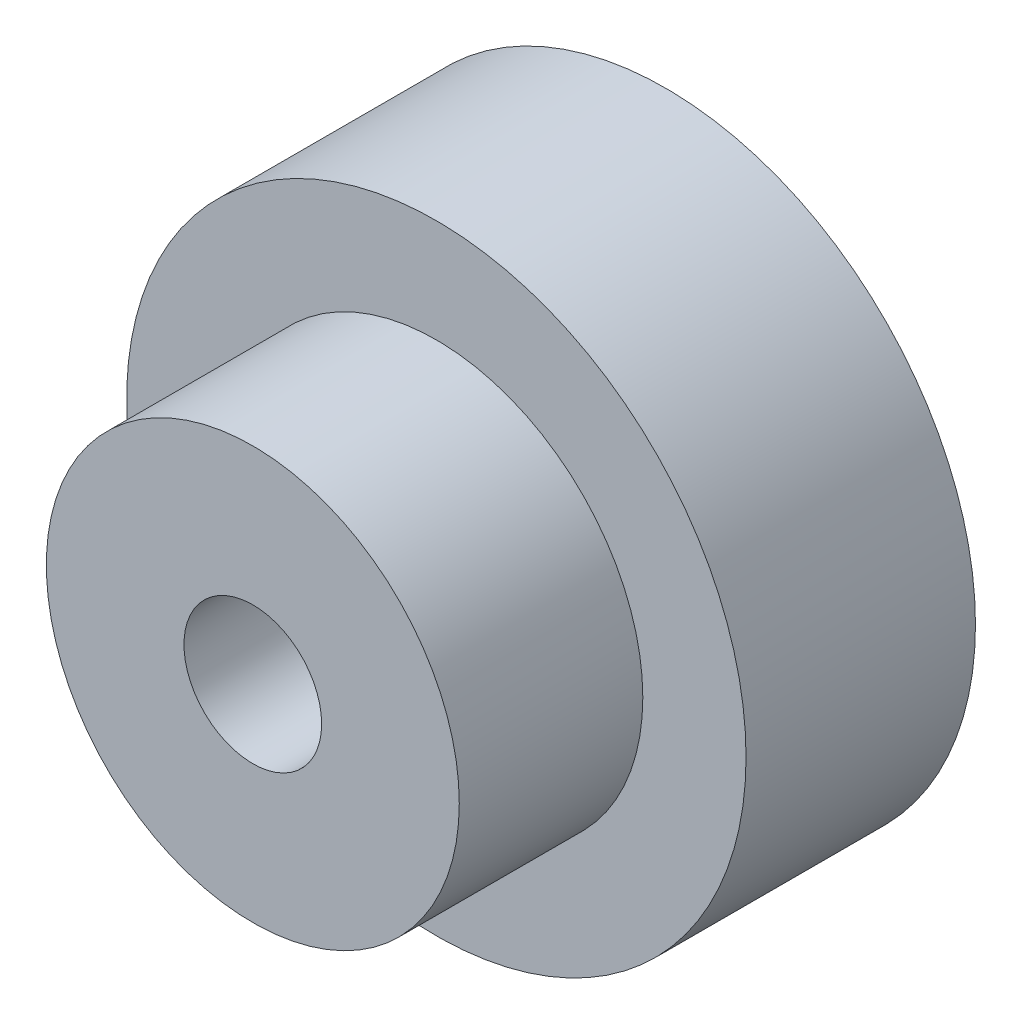
ISO-10303-21;
HEADER;
FILE_DESCRIPTION(('STEP AP214'),'2;1');
FILE_NAME('part.step','',(''),(''),'','','');
FILE_SCHEMA(('AUTOMOTIVE_DESIGN { 1 0 10303 214 1 1 1 1 }'));
ENDSEC;
DATA;
#1=APPLICATION_CONTEXT('core data for automotive mechanical design processes');
#2=APPLICATION_PROTOCOL_DEFINITION('international standard','automotive_design',2000,#1);
#3=PRODUCT_CONTEXT('',#1,'mechanical');
#4=PRODUCT('Part','Part','',(#3));
#5=PRODUCT_RELATED_PRODUCT_CATEGORY('part','',(#4));
#6=PRODUCT_DEFINITION_FORMATION('','',#4);
#7=PRODUCT_DEFINITION_CONTEXT('part definition',#1,'design');
#8=PRODUCT_DEFINITION('design','',#6,#7);
#9=PRODUCT_DEFINITION_SHAPE('','',#8);
#10=(LENGTH_UNIT() NAMED_UNIT(*) SI_UNIT(.MILLI.,.METRE.));
#11=(NAMED_UNIT(*) PLANE_ANGLE_UNIT() SI_UNIT($,.RADIAN.));
#12=(NAMED_UNIT(*) SI_UNIT($,.STERADIAN.) SOLID_ANGLE_UNIT());
#13=UNCERTAINTY_MEASURE_WITH_UNIT(LENGTH_MEASURE(1.E-05),#10,'distance_accuracy_value','');
#14=(GEOMETRIC_REPRESENTATION_CONTEXT(3) GLOBAL_UNCERTAINTY_ASSIGNED_CONTEXT((#13)) GLOBAL_UNIT_ASSIGNED_CONTEXT((#10,
#11,#12)) REPRESENTATION_CONTEXT('',''));
#15=CARTESIAN_POINT('',(0.,0.,0.));
#16=DIRECTION('',(0.,0.,1.));
#17=DIRECTION('',(1.,0.,0.));
#18=AXIS2_PLACEMENT_3D('',#15,#16,#17);
#19=CARTESIAN_POINT('',(0.,0.,10.));
#20=DIRECTION('',(0.,0.,-1.));
#21=DIRECTION('',(-1.,0.,0.));
#22=AXIS2_PLACEMENT_3D('',#19,#20,#21);
#23=CYLINDRICAL_SURFACE('',#22,13.5);
#24=CARTESIAN_POINT('',(0.,0.,10.));
#25=DIRECTION('',(0.,0.,1.));
#26=DIRECTION('',(1.,0.,0.));
#27=AXIS2_PLACEMENT_3D('',#24,#25,#26);
#28=CIRCLE('',#27,13.5);
#29=CARTESIAN_POINT('',(13.5,0.,10.));
#30=VERTEX_POINT('',#29);
#31=EDGE_CURVE('E10',#30,#30,#28,.T.);
#32=ORIENTED_EDGE('',*,*,#31,.F.);
#33=EDGE_LOOP('',(#32));
#34=FACE_BOUND('',#33,.T.);
#35=CARTESIAN_POINT('',(0.,0.,0.));
#36=DIRECTION('',(0.,0.,1.));
#37=DIRECTION('',(1.,0.,0.));
#38=AXIS2_PLACEMENT_3D('',#35,#36,#37);
#39=CIRCLE('',#38,13.5);
#40=CARTESIAN_POINT('',(13.5,0.,0.));
#41=VERTEX_POINT('',#40);
#42=EDGE_CURVE('E36',#41,#41,#39,.T.);
#43=ORIENTED_EDGE('',*,*,#42,.T.);
#44=EDGE_LOOP('',(#43));
#45=FACE_BOUND('',#44,.T.);
#46=ADVANCED_FACE('F33',(#34,#45),#23,.T.);
#47=CARTESIAN_POINT('',(0.,0.,10.));
#48=DIRECTION('',(0.,0.,1.));
#49=DIRECTION('',(1.,0.,0.));
#50=AXIS2_PLACEMENT_3D('',#47,#48,#49);
#51=PLANE('',#50);
#52=CARTESIAN_POINT('',(0.,0.,10.));
#53=DIRECTION('',(0.,0.,1.));
#54=DIRECTION('',(1.,0.,0.));
#55=AXIS2_PLACEMENT_3D('',#52,#53,#54);
#56=CIRCLE('',#55,9.);
#57=CARTESIAN_POINT('',(9.,0.,10.));
#58=VERTEX_POINT('',#57);
#59=EDGE_CURVE('E45',#58,#58,#56,.T.);
#60=ORIENTED_EDGE('',*,*,#59,.F.);
#61=EDGE_LOOP('',(#60));
#62=FACE_BOUND('',#61,.T.);
#63=ORIENTED_EDGE('',*,*,#31,.T.);
#64=EDGE_LOOP('',(#63));
#65=FACE_BOUND('',#64,.T.);
#66=ADVANCED_FACE('F78',(#62,#65),#51,.T.);
#67=CARTESIAN_POINT('',(0.,0.,0.));
#68=DIRECTION('',(0.,0.,1.));
#69=DIRECTION('',(1.,0.,0.));
#70=AXIS2_PLACEMENT_3D('',#67,#68,#69);
#71=PLANE('',#70);
#72=CARTESIAN_POINT('',(0.,0.,0.));
#73=DIRECTION('',(0.,0.,1.));
#74=DIRECTION('',(1.,0.,0.));
#75=AXIS2_PLACEMENT_3D('',#72,#73,#74);
#76=CIRCLE('',#75,3.);
#77=CARTESIAN_POINT('',(3.,0.,0.));
#78=VERTEX_POINT('',#77);
#79=EDGE_CURVE('E48',#78,#78,#76,.T.);
#80=ORIENTED_EDGE('',*,*,#79,.T.);
#81=EDGE_LOOP('',(#80));
#82=FACE_BOUND('',#81,.T.);
#83=ORIENTED_EDGE('',*,*,#42,.F.);
#84=EDGE_LOOP('',(#83));
#85=FACE_BOUND('',#84,.T.);
#86=ADVANCED_FACE('F57',(#82,#85),#71,.F.);
#87=CARTESIAN_POINT('',(0.,0.,18.));
#88=DIRECTION('',(0.,0.,-1.));
#89=DIRECTION('',(-1.,0.,0.));
#90=AXIS2_PLACEMENT_3D('',#87,#88,#89);
#91=CYLINDRICAL_SURFACE('',#90,9.);
#92=CARTESIAN_POINT('',(0.,0.,18.));
#93=DIRECTION('',(0.,0.,1.));
#94=DIRECTION('',(1.,0.,0.));
#95=AXIS2_PLACEMENT_3D('',#92,#93,#94);
#96=CIRCLE('',#95,9.);
#97=CARTESIAN_POINT('',(9.,0.,18.));
#98=VERTEX_POINT('',#97);
#99=EDGE_CURVE('E43',#98,#98,#96,.T.);
#100=ORIENTED_EDGE('',*,*,#99,.F.);
#101=EDGE_LOOP('',(#100));
#102=FACE_BOUND('',#101,.T.);
#103=ORIENTED_EDGE('',*,*,#59,.T.);
#104=EDGE_LOOP('',(#103));
#105=FACE_BOUND('',#104,.T.);
#106=ADVANCED_FACE('F69',(#102,#105),#91,.T.);
#107=CARTESIAN_POINT('',(0.,0.,18.));
#108=DIRECTION('',(0.,0.,1.));
#109=DIRECTION('',(1.,0.,0.));
#110=AXIS2_PLACEMENT_3D('',#107,#108,#109);
#111=PLANE('',#110);
#112=CARTESIAN_POINT('',(0.,0.,18.));
#113=DIRECTION('',(0.,0.,1.));
#114=DIRECTION('',(1.,0.,0.));
#115=AXIS2_PLACEMENT_3D('',#112,#113,#114);
#116=CIRCLE('',#115,3.);
#117=CARTESIAN_POINT('',(3.,0.,18.));
#118=VERTEX_POINT('',#117);
#119=EDGE_CURVE('E51',#118,#118,#116,.T.);
#120=ORIENTED_EDGE('',*,*,#119,.F.);
#121=EDGE_LOOP('',(#120));
#122=FACE_BOUND('',#121,.T.);
#123=ORIENTED_EDGE('',*,*,#99,.T.);
#124=EDGE_LOOP('',(#123));
#125=FACE_BOUND('',#124,.T.);
#126=ADVANCED_FACE('F63',(#122,#125),#111,.T.);
#127=CARTESIAN_POINT('',(0.,0.,0.));
#128=DIRECTION('',(0.,0.,1.));
#129=DIRECTION('',(1.,0.,0.));
#130=AXIS2_PLACEMENT_3D('',#127,#128,#129);
#131=CYLINDRICAL_SURFACE('',#130,3.);
#132=ORIENTED_EDGE('',*,*,#79,.F.);
#133=EDGE_LOOP('',(#132));
#134=FACE_BOUND('',#133,.T.);
#135=ORIENTED_EDGE('',*,*,#119,.T.);
#136=EDGE_LOOP('',(#135));
#137=FACE_BOUND('',#136,.T.);
#138=ADVANCED_FACE('F60',(#134,#137),#131,.F.);
#139=CLOSED_SHELL('',(#46,#66,#86,#106,#126,#138));
#140=MANIFOLD_SOLID_BREP('B2',#139);
#141=ADVANCED_BREP_SHAPE_REPRESENTATION('',(#18,#140),#14);
#142=SHAPE_DEFINITION_REPRESENTATION(#9,#141);
ENDSEC;
END-ISO-10303-21;
